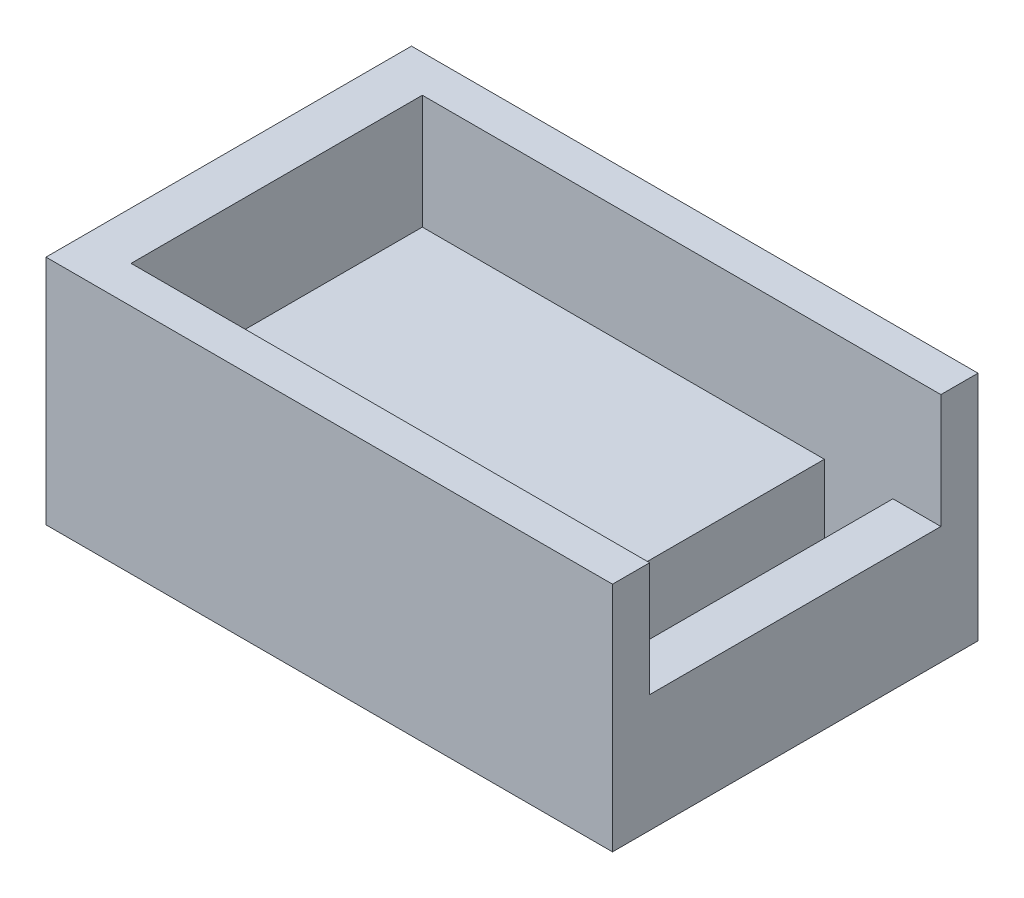
ISO-10303-21;
HEADER;
FILE_DESCRIPTION(('STEP AP214'),'2;1');
FILE_NAME('part.step','',(''),(''),'','','');
FILE_SCHEMA(('AUTOMOTIVE_DESIGN { 1 0 10303 214 1 1 1 1 }'));
ENDSEC;
DATA;
#1=APPLICATION_CONTEXT('core data for automotive mechanical design processes');
#2=APPLICATION_PROTOCOL_DEFINITION('international standard','automotive_design',2000,#1);
#3=PRODUCT_CONTEXT('',#1,'mechanical');
#4=PRODUCT('Part','Part','',(#3));
#5=PRODUCT_RELATED_PRODUCT_CATEGORY('part','',(#4));
#6=PRODUCT_DEFINITION_FORMATION('','',#4);
#7=PRODUCT_DEFINITION_CONTEXT('part definition',#1,'design');
#8=PRODUCT_DEFINITION('design','',#6,#7);
#9=PRODUCT_DEFINITION_SHAPE('','',#8);
#10=(LENGTH_UNIT() NAMED_UNIT(*) SI_UNIT(.MILLI.,.METRE.));
#11=(NAMED_UNIT(*) PLANE_ANGLE_UNIT() SI_UNIT($,.RADIAN.));
#12=(NAMED_UNIT(*) SI_UNIT($,.STERADIAN.) SOLID_ANGLE_UNIT());
#13=UNCERTAINTY_MEASURE_WITH_UNIT(LENGTH_MEASURE(1.E-05),#10,'distance_accuracy_value','');
#14=(GEOMETRIC_REPRESENTATION_CONTEXT(3) GLOBAL_UNCERTAINTY_ASSIGNED_CONTEXT((#13)) GLOBAL_UNIT_ASSIGNED_CONTEXT((#10,
#11,#12)) REPRESENTATION_CONTEXT('',''));
#15=CARTESIAN_POINT('',(0.,0.,0.));
#16=DIRECTION('',(0.,0.,1.));
#17=DIRECTION('',(1.,0.,0.));
#18=AXIS2_PLACEMENT_3D('',#15,#16,#17);
#19=CARTESIAN_POINT('',(0.,5.15,0.));
#20=DIRECTION('',(0.,1.,0.));
#21=DIRECTION('',(0.,0.,1.));
#22=AXIS2_PLACEMENT_3D('',#19,#20,#21);
#23=PLANE('',#22);
#24=DIRECTION('',(1.,0.,0.));
#25=VECTOR('',#24,1.);
#26=CARTESIAN_POINT('',(0.,5.15,1.625));
#27=LINE('',#26,#25);
#28=CARTESIAN_POINT('',(22.7,5.15,1.625));
#29=VERTEX_POINT('',#28);
#30=CARTESIAN_POINT('',(24.8,5.15,1.625));
#31=VERTEX_POINT('',#30);
#32=EDGE_CURVE('E11',#29,#31,#27,.T.);
#33=ORIENTED_EDGE('',*,*,#32,.F.);
#34=DIRECTION('',(0.,0.,-1.));
#35=VECTOR('',#34,1.);
#36=CARTESIAN_POINT('',(22.7,5.15,1.625));
#37=LINE('',#36,#35);
#38=CARTESIAN_POINT('',(22.7,5.15,14.375));
#39=VERTEX_POINT('',#38);
#40=EDGE_CURVE('E168',#39,#29,#37,.T.);
#41=ORIENTED_EDGE('',*,*,#40,.F.);
#42=DIRECTION('',(1.,0.,0.));
#43=VECTOR('',#42,1.);
#44=CARTESIAN_POINT('',(0.,5.15,14.375));
#45=LINE('',#44,#43);
#46=CARTESIAN_POINT('',(24.8,5.15,14.375));
#47=VERTEX_POINT('',#46);
#48=EDGE_CURVE('E45',#39,#47,#45,.T.);
#49=ORIENTED_EDGE('',*,*,#48,.T.);
#50=DIRECTION('',(0.,0.,-1.));
#51=VECTOR('',#50,1.);
#52=CARTESIAN_POINT('',(24.8,5.15,0.));
#53=LINE('',#52,#51);
#54=EDGE_CURVE('E188',#47,#31,#53,.T.);
#55=ORIENTED_EDGE('',*,*,#54,.T.);
#56=EDGE_LOOP('',(#33,#41,#49,#55));
#57=FACE_BOUND('',#56,.T.);
#58=ADVANCED_FACE('F36',(#57),#23,.T.);
#59=CARTESIAN_POINT('',(2.1,5.15,1.625));
#60=VERTEX_POINT('',#59);
#61=CARTESIAN_POINT('',(19.7,5.15,1.625));
#62=VERTEX_POINT('',#61);
#63=EDGE_CURVE('E47',#60,#62,#27,.T.);
#64=ORIENTED_EDGE('',*,*,#63,.F.);
#65=DIRECTION('',(0.,0.,1.));
#66=VECTOR('',#65,1.);
#67=CARTESIAN_POINT('',(2.1,5.15,0.));
#68=LINE('',#67,#66);
#69=CARTESIAN_POINT('',(2.1,5.15,14.375));
#70=VERTEX_POINT('',#69);
#71=EDGE_CURVE('E153',#60,#70,#68,.T.);
#72=ORIENTED_EDGE('',*,*,#71,.T.);
#73=CARTESIAN_POINT('',(19.7,5.15,14.375));
#74=VERTEX_POINT('',#73);
#75=EDGE_CURVE('E209',#70,#74,#45,.T.);
#76=ORIENTED_EDGE('',*,*,#75,.T.);
#77=DIRECTION('',(0.,0.,1.));
#78=VECTOR('',#77,1.);
#79=CARTESIAN_POINT('',(19.7,5.15,1.625));
#80=LINE('',#79,#78);
#81=EDGE_CURVE('E165',#62,#74,#80,.T.);
#82=ORIENTED_EDGE('',*,*,#81,.F.);
#83=EDGE_LOOP('',(#64,#72,#76,#82));
#84=FACE_BOUND('',#83,.T.);
#85=ADVANCED_FACE('F243',(#84),#23,.T.);
#86=CARTESIAN_POINT('',(0.,0.,0.));
#87=DIRECTION('',(0.,1.,0.));
#88=DIRECTION('',(0.,0.,1.));
#89=AXIS2_PLACEMENT_3D('',#86,#87,#88);
#90=PLANE('',#89);
#91=DIRECTION('',(0.,0.,1.));
#92=VECTOR('',#91,1.);
#93=CARTESIAN_POINT('',(0.,0.,0.));
#94=LINE('',#93,#92);
#95=CARTESIAN_POINT('',(0.,0.,0.));
#96=VERTEX_POINT('',#95);
#97=CARTESIAN_POINT('',(0.,0.,16.));
#98=VERTEX_POINT('',#97);
#99=EDGE_CURVE('E187',#96,#98,#94,.T.);
#100=ORIENTED_EDGE('',*,*,#99,.F.);
#101=DIRECTION('',(-1.,0.,0.));
#102=VECTOR('',#101,1.);
#103=CARTESIAN_POINT('',(0.,0.,0.));
#104=LINE('',#103,#102);
#105=CARTESIAN_POINT('',(24.8,0.,0.));
#106=VERTEX_POINT('',#105);
#107=EDGE_CURVE('E191',#106,#96,#104,.T.);
#108=ORIENTED_EDGE('',*,*,#107,.F.);
#109=DIRECTION('',(0.,0.,-1.));
#110=VECTOR('',#109,1.);
#111=CARTESIAN_POINT('',(24.8,0.,0.));
#112=LINE('',#111,#110);
#113=CARTESIAN_POINT('',(24.8,0.,16.));
#114=VERTEX_POINT('',#113);
#115=EDGE_CURVE('E196',#114,#106,#112,.T.);
#116=ORIENTED_EDGE('',*,*,#115,.F.);
#117=DIRECTION('',(1.,0.,0.));
#118=VECTOR('',#117,1.);
#119=CARTESIAN_POINT('',(0.,0.,16.));
#120=LINE('',#119,#118);
#121=EDGE_CURVE('E194',#98,#114,#120,.T.);
#122=ORIENTED_EDGE('',*,*,#121,.F.);
#123=EDGE_LOOP('',(#100,#108,#116,#122));
#124=FACE_BOUND('',#123,.T.);
#125=DIRECTION('',(0.,0.,1.));
#126=VECTOR('',#125,1.);
#127=CARTESIAN_POINT('',(19.7,0.,1.625));
#128=LINE('',#127,#126);
#129=CARTESIAN_POINT('',(19.7,0.,1.625));
#130=VERTEX_POINT('',#129);
#131=CARTESIAN_POINT('',(19.7,0.,14.375));
#132=VERTEX_POINT('',#131);
#133=EDGE_CURVE('E62',#130,#132,#128,.T.);
#134=ORIENTED_EDGE('',*,*,#133,.T.);
#135=DIRECTION('',(1.,0.,0.));
#136=VECTOR('',#135,1.);
#137=CARTESIAN_POINT('',(19.7,0.,14.375));
#138=LINE('',#137,#136);
#139=CARTESIAN_POINT('',(22.7,0.,14.375));
#140=VERTEX_POINT('',#139);
#141=EDGE_CURVE('E159',#132,#140,#138,.T.);
#142=ORIENTED_EDGE('',*,*,#141,.T.);
#143=DIRECTION('',(0.,0.,-1.));
#144=VECTOR('',#143,1.);
#145=CARTESIAN_POINT('',(22.7,0.,1.625));
#146=LINE('',#145,#144);
#147=CARTESIAN_POINT('',(22.7,0.,1.625));
#148=VERTEX_POINT('',#147);
#149=EDGE_CURVE('E175',#140,#148,#146,.T.);
#150=ORIENTED_EDGE('',*,*,#149,.T.);
#151=DIRECTION('',(-1.,0.,0.));
#152=VECTOR('',#151,1.);
#153=CARTESIAN_POINT('',(19.7,0.,1.625));
#154=LINE('',#153,#152);
#155=EDGE_CURVE('E169',#148,#130,#154,.T.);
#156=ORIENTED_EDGE('',*,*,#155,.T.);
#157=EDGE_LOOP('',(#134,#142,#150,#156));
#158=FACE_BOUND('',#157,.T.);
#159=ADVANCED_FACE('F235',(#124,#158),#90,.F.);
#160=CARTESIAN_POINT('',(0.,5.15,0.));
#161=DIRECTION('',(1.,0.,0.));
#162=DIRECTION('',(0.,0.,-1.));
#163=AXIS2_PLACEMENT_3D('',#160,#161,#162);
#164=PLANE('',#163);
#165=ORIENTED_EDGE('',*,*,#99,.T.);
#166=DIRECTION('',(0.,-1.,0.));
#167=VECTOR('',#166,1.);
#168=CARTESIAN_POINT('',(0.,5.15,16.));
#169=LINE('',#168,#167);
#170=CARTESIAN_POINT('',(0.,10.15,16.));
#171=VERTEX_POINT('',#170);
#172=EDGE_CURVE('E40',#171,#98,#169,.T.);
#173=ORIENTED_EDGE('',*,*,#172,.F.);
#174=DIRECTION('',(0.,0.,1.));
#175=VECTOR('',#174,1.);
#176=CARTESIAN_POINT('',(0.,10.15,0.));
#177=LINE('',#176,#175);
#178=CARTESIAN_POINT('',(0.,10.15,0.));
#179=VERTEX_POINT('',#178);
#180=EDGE_CURVE('E226',#179,#171,#177,.T.);
#181=ORIENTED_EDGE('',*,*,#180,.F.);
#182=DIRECTION('',(0.,-1.,0.));
#183=VECTOR('',#182,1.);
#184=CARTESIAN_POINT('',(0.,5.15,0.));
#185=LINE('',#184,#183);
#186=EDGE_CURVE('E190',#179,#96,#185,.T.);
#187=ORIENTED_EDGE('',*,*,#186,.T.);
#188=EDGE_LOOP('',(#165,#173,#181,#187));
#189=FACE_BOUND('',#188,.T.);
#190=ADVANCED_FACE('F38',(#189),#164,.F.);
#191=CARTESIAN_POINT('',(0.,5.15,16.));
#192=DIRECTION('',(0.,0.,-1.));
#193=DIRECTION('',(-1.,0.,0.));
#194=AXIS2_PLACEMENT_3D('',#191,#192,#193);
#195=PLANE('',#194);
#196=ORIENTED_EDGE('',*,*,#121,.T.);
#197=DIRECTION('',(0.,-1.,0.));
#198=VECTOR('',#197,1.);
#199=CARTESIAN_POINT('',(24.8,5.15,16.));
#200=LINE('',#199,#198);
#201=CARTESIAN_POINT('',(24.8,10.15,16.));
#202=VERTEX_POINT('',#201);
#203=EDGE_CURVE('E201',#202,#114,#200,.T.);
#204=ORIENTED_EDGE('',*,*,#203,.F.);
#205=DIRECTION('',(1.,0.,0.));
#206=VECTOR('',#205,1.);
#207=CARTESIAN_POINT('',(0.,10.15,16.));
#208=LINE('',#207,#206);
#209=EDGE_CURVE('E223',#171,#202,#208,.T.);
#210=ORIENTED_EDGE('',*,*,#209,.F.);
#211=ORIENTED_EDGE('',*,*,#172,.T.);
#212=EDGE_LOOP('',(#196,#204,#210,#211));
#213=FACE_BOUND('',#212,.T.);
#214=ADVANCED_FACE('F237',(#213),#195,.F.);
#215=CARTESIAN_POINT('',(24.8,5.15,0.));
#216=DIRECTION('',(-1.,0.,0.));
#217=DIRECTION('',(0.,0.,1.));
#218=AXIS2_PLACEMENT_3D('',#215,#216,#217);
#219=PLANE('',#218);
#220=ORIENTED_EDGE('',*,*,#115,.T.);
#221=DIRECTION('',(0.,-1.,0.));
#222=VECTOR('',#221,1.);
#223=CARTESIAN_POINT('',(24.8,5.15,0.));
#224=LINE('',#223,#222);
#225=CARTESIAN_POINT('',(24.8,10.15,0.));
#226=VERTEX_POINT('',#225);
#227=EDGE_CURVE('E138',#226,#106,#224,.T.);
#228=ORIENTED_EDGE('',*,*,#227,.F.);
#229=DIRECTION('',(0.,0.,-1.));
#230=VECTOR('',#229,1.);
#231=CARTESIAN_POINT('',(24.8,10.15,0.));
#232=LINE('',#231,#230);
#233=CARTESIAN_POINT('',(24.8,10.15,1.625));
#234=VERTEX_POINT('',#233);
#235=EDGE_CURVE('E130',#234,#226,#232,.T.);
#236=ORIENTED_EDGE('',*,*,#235,.F.);
#237=DIRECTION('',(0.,-1.,0.));
#238=VECTOR('',#237,1.);
#239=CARTESIAN_POINT('',(24.8,10.15,1.625));
#240=LINE('',#239,#238);
#241=EDGE_CURVE('E135',#234,#31,#240,.T.);
#242=ORIENTED_EDGE('',*,*,#241,.T.);
#243=ORIENTED_EDGE('',*,*,#54,.F.);
#244=DIRECTION('',(0.,-1.,0.));
#245=VECTOR('',#244,1.);
#246=CARTESIAN_POINT('',(24.8,10.15,14.375));
#247=LINE('',#246,#245);
#248=CARTESIAN_POINT('',(24.8,10.15,14.375));
#249=VERTEX_POINT('',#248);
#250=EDGE_CURVE('E54',#249,#47,#247,.T.);
#251=ORIENTED_EDGE('',*,*,#250,.F.);
#252=EDGE_CURVE('E145',#202,#249,#232,.T.);
#253=ORIENTED_EDGE('',*,*,#252,.F.);
#254=ORIENTED_EDGE('',*,*,#203,.T.);
#255=EDGE_LOOP('',(#220,#228,#236,#242,#243,#251,#253,#254));
#256=FACE_BOUND('',#255,.T.);
#257=ADVANCED_FACE('F132',(#256),#219,.F.);
#258=CARTESIAN_POINT('',(0.,5.15,0.));
#259=DIRECTION('',(0.,0.,1.));
#260=DIRECTION('',(1.,0.,0.));
#261=AXIS2_PLACEMENT_3D('',#258,#259,#260);
#262=PLANE('',#261);
#263=ORIENTED_EDGE('',*,*,#107,.T.);
#264=ORIENTED_EDGE('',*,*,#186,.F.);
#265=DIRECTION('',(-1.,0.,0.));
#266=VECTOR('',#265,1.);
#267=CARTESIAN_POINT('',(0.,10.15,0.));
#268=LINE('',#267,#266);
#269=EDGE_CURVE('E142',#226,#179,#268,.T.);
#270=ORIENTED_EDGE('',*,*,#269,.F.);
#271=ORIENTED_EDGE('',*,*,#227,.T.);
#272=EDGE_LOOP('',(#263,#264,#270,#271));
#273=FACE_BOUND('',#272,.T.);
#274=ADVANCED_FACE('F260',(#273),#262,.F.);
#275=CARTESIAN_POINT('',(19.7,5.15,1.625));
#276=DIRECTION('',(1.,0.,0.));
#277=DIRECTION('',(0.,0.,-1.));
#278=AXIS2_PLACEMENT_3D('',#275,#276,#277);
#279=PLANE('',#278);
#280=ORIENTED_EDGE('',*,*,#133,.F.);
#281=DIRECTION('',(0.,-1.,0.));
#282=VECTOR('',#281,1.);
#283=CARTESIAN_POINT('',(19.7,5.15,1.625));
#284=LINE('',#283,#282);
#285=EDGE_CURVE('E171',#62,#130,#284,.T.);
#286=ORIENTED_EDGE('',*,*,#285,.F.);
#287=ORIENTED_EDGE('',*,*,#81,.T.);
#288=DIRECTION('',(0.,-1.,0.));
#289=VECTOR('',#288,1.);
#290=CARTESIAN_POINT('',(19.7,5.15,14.375));
#291=LINE('',#290,#289);
#292=EDGE_CURVE('E185',#74,#132,#291,.T.);
#293=ORIENTED_EDGE('',*,*,#292,.T.);
#294=EDGE_LOOP('',(#280,#286,#287,#293));
#295=FACE_BOUND('',#294,.T.);
#296=ADVANCED_FACE('F245',(#295),#279,.T.);
#297=CARTESIAN_POINT('',(19.7,5.15,14.375));
#298=DIRECTION('',(0.,0.,-1.));
#299=DIRECTION('',(-1.,0.,0.));
#300=AXIS2_PLACEMENT_3D('',#297,#298,#299);
#301=PLANE('',#300);
#302=ORIENTED_EDGE('',*,*,#141,.F.);
#303=ORIENTED_EDGE('',*,*,#292,.F.);
#304=ORIENTED_EDGE('',*,*,#75,.F.);
#305=DIRECTION('',(0.,-1.,0.));
#306=VECTOR('',#305,1.);
#307=CARTESIAN_POINT('',(2.1,10.15,14.375));
#308=LINE('',#307,#306);
#309=CARTESIAN_POINT('',(2.1,10.15,14.375));
#310=VERTEX_POINT('',#309);
#311=EDGE_CURVE('E161',#310,#70,#308,.T.);
#312=ORIENTED_EDGE('',*,*,#311,.F.);
#313=DIRECTION('',(1.,0.,0.));
#314=VECTOR('',#313,1.);
#315=CARTESIAN_POINT('',(0.,10.15,14.375));
#316=LINE('',#315,#314);
#317=EDGE_CURVE('E221',#310,#249,#316,.T.);
#318=ORIENTED_EDGE('',*,*,#317,.T.);
#319=ORIENTED_EDGE('',*,*,#250,.T.);
#320=ORIENTED_EDGE('',*,*,#48,.F.);
#321=DIRECTION('',(0.,-1.,0.));
#322=VECTOR('',#321,1.);
#323=CARTESIAN_POINT('',(22.7,5.15,14.375));
#324=LINE('',#323,#322);
#325=EDGE_CURVE('E183',#39,#140,#324,.T.);
#326=ORIENTED_EDGE('',*,*,#325,.T.);
#327=EDGE_LOOP('',(#302,#303,#304,#312,#318,#319,#320,#326));
#328=FACE_BOUND('',#327,.T.);
#329=ADVANCED_FACE('F238',(#328),#301,.T.);
#330=CARTESIAN_POINT('',(22.7,5.15,1.625));
#331=DIRECTION('',(-1.,0.,0.));
#332=DIRECTION('',(0.,0.,1.));
#333=AXIS2_PLACEMENT_3D('',#330,#331,#332);
#334=PLANE('',#333);
#335=ORIENTED_EDGE('',*,*,#149,.F.);
#336=ORIENTED_EDGE('',*,*,#325,.F.);
#337=ORIENTED_EDGE('',*,*,#40,.T.);
#338=DIRECTION('',(0.,-1.,0.));
#339=VECTOR('',#338,1.);
#340=CARTESIAN_POINT('',(22.7,5.15,1.625));
#341=LINE('',#340,#339);
#342=EDGE_CURVE('E181',#29,#148,#341,.T.);
#343=ORIENTED_EDGE('',*,*,#342,.T.);
#344=EDGE_LOOP('',(#335,#336,#337,#343));
#345=FACE_BOUND('',#344,.T.);
#346=ADVANCED_FACE('F249',(#345),#334,.T.);
#347=CARTESIAN_POINT('',(19.7,5.15,1.625));
#348=DIRECTION('',(0.,0.,1.));
#349=DIRECTION('',(1.,0.,0.));
#350=AXIS2_PLACEMENT_3D('',#347,#348,#349);
#351=PLANE('',#350);
#352=ORIENTED_EDGE('',*,*,#155,.F.);
#353=ORIENTED_EDGE('',*,*,#342,.F.);
#354=ORIENTED_EDGE('',*,*,#32,.T.);
#355=ORIENTED_EDGE('',*,*,#241,.F.);
#356=DIRECTION('',(1.,0.,0.));
#357=VECTOR('',#356,1.);
#358=CARTESIAN_POINT('',(0.,10.15,1.625));
#359=LINE('',#358,#357);
#360=CARTESIAN_POINT('',(2.1,10.15,1.625));
#361=VERTEX_POINT('',#360);
#362=EDGE_CURVE('E143',#361,#234,#359,.T.);
#363=ORIENTED_EDGE('',*,*,#362,.F.);
#364=DIRECTION('',(0.,-1.,0.));
#365=VECTOR('',#364,1.);
#366=CARTESIAN_POINT('',(2.1,10.15,1.625));
#367=LINE('',#366,#365);
#368=EDGE_CURVE('E220',#361,#60,#367,.T.);
#369=ORIENTED_EDGE('',*,*,#368,.T.);
#370=ORIENTED_EDGE('',*,*,#63,.T.);
#371=ORIENTED_EDGE('',*,*,#285,.T.);
#372=EDGE_LOOP('',(#352,#353,#354,#355,#363,#369,#370,#371));
#373=FACE_BOUND('',#372,.T.);
#374=ADVANCED_FACE('F156',(#373),#351,.T.);
#375=CARTESIAN_POINT('',(2.1,10.15,0.));
#376=DIRECTION('',(1.,0.,0.));
#377=DIRECTION('',(0.,0.,-1.));
#378=AXIS2_PLACEMENT_3D('',#375,#376,#377);
#379=PLANE('',#378);
#380=ORIENTED_EDGE('',*,*,#71,.F.);
#381=ORIENTED_EDGE('',*,*,#368,.F.);
#382=DIRECTION('',(0.,0.,1.));
#383=VECTOR('',#382,1.);
#384=CARTESIAN_POINT('',(2.1,10.15,0.));
#385=LINE('',#384,#383);
#386=EDGE_CURVE('E151',#361,#310,#385,.T.);
#387=ORIENTED_EDGE('',*,*,#386,.T.);
#388=ORIENTED_EDGE('',*,*,#311,.T.);
#389=EDGE_LOOP('',(#380,#381,#387,#388));
#390=FACE_BOUND('',#389,.T.);
#391=ADVANCED_FACE('F241',(#390),#379,.T.);
#392=CARTESIAN_POINT('',(0.,10.15,0.));
#393=DIRECTION('',(0.,1.,0.));
#394=DIRECTION('',(0.,0.,1.));
#395=AXIS2_PLACEMENT_3D('',#392,#393,#394);
#396=PLANE('',#395);
#397=ORIENTED_EDGE('',*,*,#362,.T.);
#398=ORIENTED_EDGE('',*,*,#235,.T.);
#399=ORIENTED_EDGE('',*,*,#269,.T.);
#400=ORIENTED_EDGE('',*,*,#180,.T.);
#401=ORIENTED_EDGE('',*,*,#209,.T.);
#402=ORIENTED_EDGE('',*,*,#252,.T.);
#403=ORIENTED_EDGE('',*,*,#317,.F.);
#404=ORIENTED_EDGE('',*,*,#386,.F.);
#405=EDGE_LOOP('',(#397,#398,#399,#400,#401,#402,#403,#404));
#406=FACE_BOUND('',#405,.T.);
#407=ADVANCED_FACE('F148',(#406),#396,.T.);
#408=CLOSED_SHELL('',(#58,#85,#159,#190,#214,#257,#274,#296,#329,#346,#374,#391,#407));
#409=MANIFOLD_SOLID_BREP('B2',#408);
#410=ADVANCED_BREP_SHAPE_REPRESENTATION('',(#18,#409),#14);
#411=SHAPE_DEFINITION_REPRESENTATION(#9,#410);
ENDSEC;
END-ISO-10303-21;
